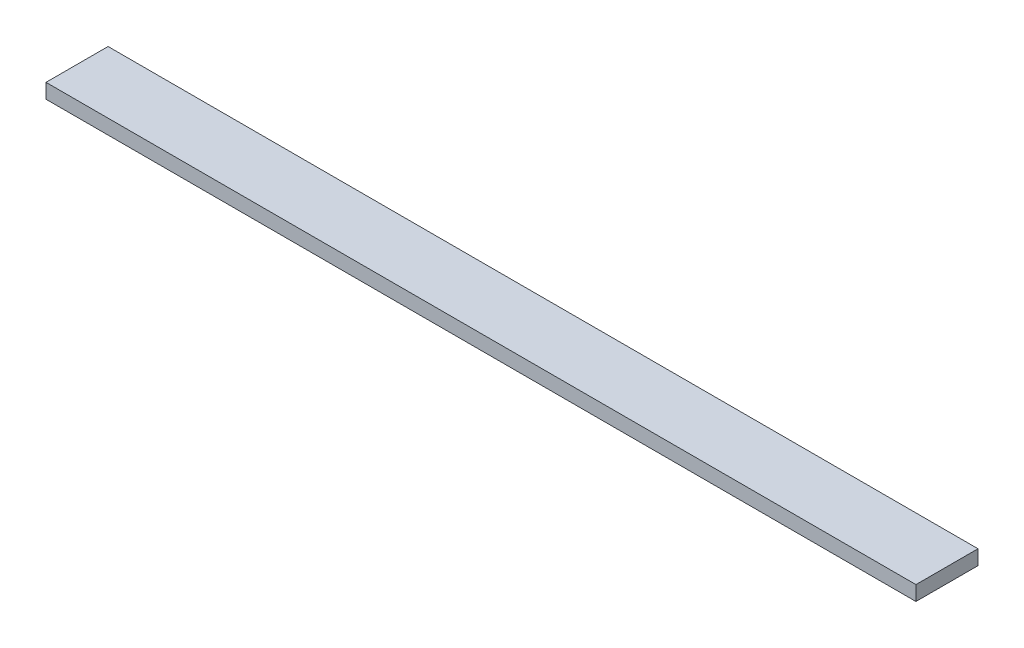
ISO-10303-21;
HEADER;
FILE_DESCRIPTION(('STEP AP214'),'2;1');
FILE_NAME('part.step','',(''),(''),'','','');
FILE_SCHEMA(('AUTOMOTIVE_DESIGN { 1 0 10303 214 1 1 1 1 }'));
ENDSEC;
DATA;
#1=APPLICATION_CONTEXT('core data for automotive mechanical design processes');
#2=APPLICATION_PROTOCOL_DEFINITION('international standard','automotive_design',2000,#1);
#3=PRODUCT_CONTEXT('',#1,'mechanical');
#4=PRODUCT('Part','Part','',(#3));
#5=PRODUCT_RELATED_PRODUCT_CATEGORY('part','',(#4));
#6=PRODUCT_DEFINITION_FORMATION('','',#4);
#7=PRODUCT_DEFINITION_CONTEXT('part definition',#1,'design');
#8=PRODUCT_DEFINITION('design','',#6,#7);
#9=PRODUCT_DEFINITION_SHAPE('','',#8);
#10=(LENGTH_UNIT() NAMED_UNIT(*) SI_UNIT(.MILLI.,.METRE.));
#11=(NAMED_UNIT(*) PLANE_ANGLE_UNIT() SI_UNIT($,.RADIAN.));
#12=(NAMED_UNIT(*) SI_UNIT($,.STERADIAN.) SOLID_ANGLE_UNIT());
#13=UNCERTAINTY_MEASURE_WITH_UNIT(LENGTH_MEASURE(1.E-05),#10,'distance_accuracy_value','');
#14=(GEOMETRIC_REPRESENTATION_CONTEXT(3) GLOBAL_UNCERTAINTY_ASSIGNED_CONTEXT((#13)) GLOBAL_UNIT_ASSIGNED_CONTEXT((#10,
#11,#12)) REPRESENTATION_CONTEXT('',''));
#15=CARTESIAN_POINT('',(0.,0.,0.));
#16=DIRECTION('',(0.,0.,1.));
#17=DIRECTION('',(1.,0.,0.));
#18=AXIS2_PLACEMENT_3D('',#15,#16,#17);
#19=CARTESIAN_POINT('',(0.,3.,0.));
#20=DIRECTION('',(1.,0.,0.));
#21=DIRECTION('',(0.,0.,-1.));
#22=AXIS2_PLACEMENT_3D('',#19,#20,#21);
#23=PLANE('',#22);
#24=DIRECTION('',(0.,0.,1.));
#25=VECTOR('',#24,1.);
#26=CARTESIAN_POINT('',(0.,0.,0.));
#27=LINE('',#26,#25);
#28=CARTESIAN_POINT('',(0.,0.,-12.7));
#29=VERTEX_POINT('',#28);
#30=CARTESIAN_POINT('',(0.,0.,0.));
#31=VERTEX_POINT('',#30);
#32=EDGE_CURVE('E98',#29,#31,#27,.T.);
#33=ORIENTED_EDGE('',*,*,#32,.T.);
#34=DIRECTION('',(0.,-1.,0.));
#35=VECTOR('',#34,1.);
#36=CARTESIAN_POINT('',(0.,3.,0.));
#37=LINE('',#36,#35);
#38=CARTESIAN_POINT('',(0.,3.,0.));
#39=VERTEX_POINT('',#38);
#40=EDGE_CURVE('E11',#39,#31,#37,.T.);
#41=ORIENTED_EDGE('',*,*,#40,.F.);
#42=DIRECTION('',(0.,0.,1.));
#43=VECTOR('',#42,1.);
#44=CARTESIAN_POINT('',(0.,3.,0.));
#45=LINE('',#44,#43);
#46=CARTESIAN_POINT('',(0.,3.,-12.7));
#47=VERTEX_POINT('',#46);
#48=EDGE_CURVE('E86',#47,#39,#45,.T.);
#49=ORIENTED_EDGE('',*,*,#48,.F.);
#50=DIRECTION('',(0.,-1.,0.));
#51=VECTOR('',#50,1.);
#52=CARTESIAN_POINT('',(0.,3.,-12.7));
#53=LINE('',#52,#51);
#54=EDGE_CURVE('E94',#47,#29,#53,.T.);
#55=ORIENTED_EDGE('',*,*,#54,.T.);
#56=EDGE_LOOP('',(#33,#41,#49,#55));
#57=FACE_BOUND('',#56,.T.);
#58=ADVANCED_FACE('F35',(#57),#23,.F.);
#59=CARTESIAN_POINT('',(0.,3.,0.));
#60=DIRECTION('',(0.,0.,-1.));
#61=DIRECTION('',(-1.,0.,0.));
#62=AXIS2_PLACEMENT_3D('',#59,#60,#61);
#63=PLANE('',#62);
#64=DIRECTION('',(1.,0.,0.));
#65=VECTOR('',#64,1.);
#66=CARTESIAN_POINT('',(0.,0.,0.));
#67=LINE('',#66,#65);
#68=CARTESIAN_POINT('',(178.,0.,0.));
#69=VERTEX_POINT('',#68);
#70=EDGE_CURVE('E90',#31,#69,#67,.T.);
#71=ORIENTED_EDGE('',*,*,#70,.T.);
#72=DIRECTION('',(0.,-1.,0.));
#73=VECTOR('',#72,1.);
#74=CARTESIAN_POINT('',(178.,3.,0.));
#75=LINE('',#74,#73);
#76=CARTESIAN_POINT('',(178.,3.,0.));
#77=VERTEX_POINT('',#76);
#78=EDGE_CURVE('E43',#77,#69,#75,.T.);
#79=ORIENTED_EDGE('',*,*,#78,.F.);
#80=DIRECTION('',(1.,0.,0.));
#81=VECTOR('',#80,1.);
#82=CARTESIAN_POINT('',(0.,3.,0.));
#83=LINE('',#82,#81);
#84=EDGE_CURVE('E81',#39,#77,#83,.T.);
#85=ORIENTED_EDGE('',*,*,#84,.F.);
#86=ORIENTED_EDGE('',*,*,#40,.T.);
#87=EDGE_LOOP('',(#71,#79,#85,#86));
#88=FACE_BOUND('',#87,.T.);
#89=ADVANCED_FACE('F89',(#88),#63,.F.);
#90=CARTESIAN_POINT('',(178.,3.,0.));
#91=DIRECTION('',(-1.,0.,0.));
#92=DIRECTION('',(0.,0.,1.));
#93=AXIS2_PLACEMENT_3D('',#90,#91,#92);
#94=PLANE('',#93);
#95=DIRECTION('',(0.,0.,-1.));
#96=VECTOR('',#95,1.);
#97=CARTESIAN_POINT('',(178.,0.,0.));
#98=LINE('',#97,#96);
#99=CARTESIAN_POINT('',(178.,0.,-12.7));
#100=VERTEX_POINT('',#99);
#101=EDGE_CURVE('E68',#69,#100,#98,.T.);
#102=ORIENTED_EDGE('',*,*,#101,.T.);
#103=DIRECTION('',(0.,-1.,0.));
#104=VECTOR('',#103,1.);
#105=CARTESIAN_POINT('',(178.,3.,-12.7));
#106=LINE('',#105,#104);
#107=CARTESIAN_POINT('',(178.,3.,-12.7));
#108=VERTEX_POINT('',#107);
#109=EDGE_CURVE('E91',#108,#100,#106,.T.);
#110=ORIENTED_EDGE('',*,*,#109,.F.);
#111=DIRECTION('',(0.,0.,-1.));
#112=VECTOR('',#111,1.);
#113=CARTESIAN_POINT('',(178.,3.,0.));
#114=LINE('',#113,#112);
#115=EDGE_CURVE('E84',#77,#108,#114,.T.);
#116=ORIENTED_EDGE('',*,*,#115,.F.);
#117=ORIENTED_EDGE('',*,*,#78,.T.);
#118=EDGE_LOOP('',(#102,#110,#116,#117));
#119=FACE_BOUND('',#118,.T.);
#120=ADVANCED_FACE('F92',(#119),#94,.F.);
#121=CARTESIAN_POINT('',(0.,3.,-12.7));
#122=DIRECTION('',(0.,0.,1.));
#123=DIRECTION('',(1.,0.,0.));
#124=AXIS2_PLACEMENT_3D('',#121,#122,#123);
#125=PLANE('',#124);
#126=DIRECTION('',(-1.,0.,0.));
#127=VECTOR('',#126,1.);
#128=CARTESIAN_POINT('',(0.,0.,-12.7));
#129=LINE('',#128,#127);
#130=EDGE_CURVE('E74',#100,#29,#129,.T.);
#131=ORIENTED_EDGE('',*,*,#130,.T.);
#132=ORIENTED_EDGE('',*,*,#54,.F.);
#133=DIRECTION('',(-1.,0.,0.));
#134=VECTOR('',#133,1.);
#135=CARTESIAN_POINT('',(0.,3.,-12.7));
#136=LINE('',#135,#134);
#137=EDGE_CURVE('E51',#108,#47,#136,.T.);
#138=ORIENTED_EDGE('',*,*,#137,.F.);
#139=ORIENTED_EDGE('',*,*,#109,.T.);
#140=EDGE_LOOP('',(#131,#132,#138,#139));
#141=FACE_BOUND('',#140,.T.);
#142=ADVANCED_FACE('F105',(#141),#125,.F.);
#143=CARTESIAN_POINT('',(0.,3.,0.));
#144=DIRECTION('',(0.,-1.,0.));
#145=DIRECTION('',(0.,0.,-1.));
#146=AXIS2_PLACEMENT_3D('',#143,#144,#145);
#147=PLANE('',#146);
#148=ORIENTED_EDGE('',*,*,#48,.T.);
#149=ORIENTED_EDGE('',*,*,#84,.T.);
#150=ORIENTED_EDGE('',*,*,#115,.T.);
#151=ORIENTED_EDGE('',*,*,#137,.T.);
#152=EDGE_LOOP('',(#148,#149,#150,#151));
#153=FACE_BOUND('',#152,.T.);
#154=ADVANCED_FACE('F82',(#153),#147,.F.);
#155=CARTESIAN_POINT('',(0.,0.,0.));
#156=DIRECTION('',(0.,-1.,0.));
#157=DIRECTION('',(0.,0.,-1.));
#158=AXIS2_PLACEMENT_3D('',#155,#156,#157);
#159=PLANE('',#158);
#160=ORIENTED_EDGE('',*,*,#32,.F.);
#161=ORIENTED_EDGE('',*,*,#130,.F.);
#162=ORIENTED_EDGE('',*,*,#101,.F.);
#163=ORIENTED_EDGE('',*,*,#70,.F.);
#164=EDGE_LOOP('',(#160,#161,#162,#163));
#165=FACE_BOUND('',#164,.T.);
#166=ADVANCED_FACE('F108',(#165),#159,.T.);
#167=CLOSED_SHELL('',(#58,#89,#120,#142,#154,#166));
#168=MANIFOLD_SOLID_BREP('B2',#167);
#169=ADVANCED_BREP_SHAPE_REPRESENTATION('',(#18,#168),#14);
#170=SHAPE_DEFINITION_REPRESENTATION(#9,#169);
ENDSEC;
END-ISO-10303-21;
